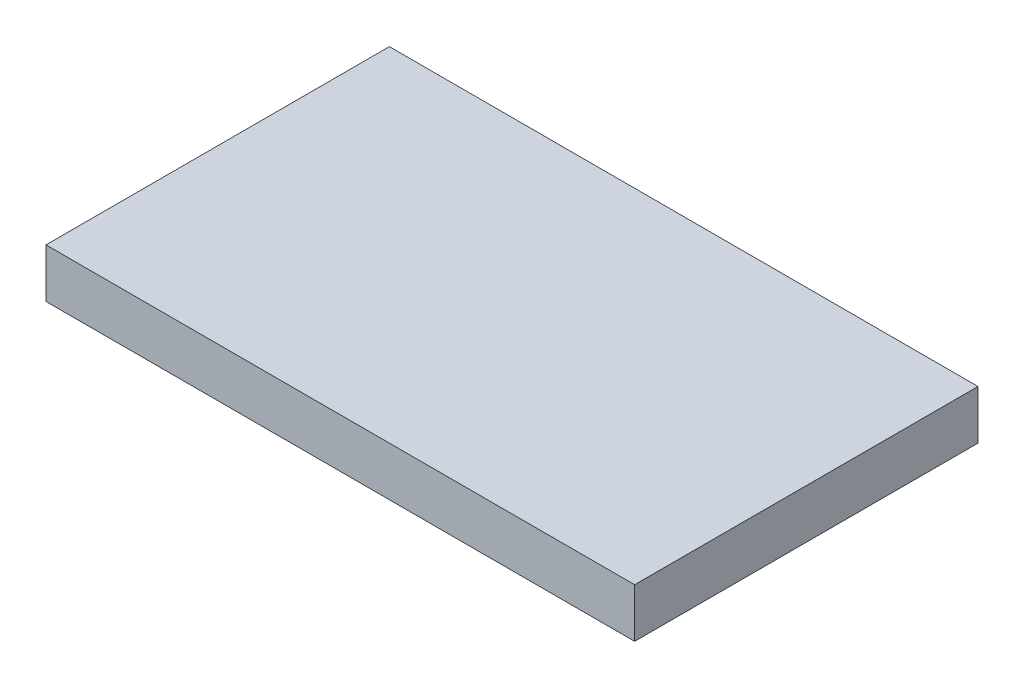
ISO-10303-21;
HEADER;
FILE_DESCRIPTION(('STEP AP214'),'2;1');
FILE_NAME('part.step','',(''),(''),'','','');
FILE_SCHEMA(('AUTOMOTIVE_DESIGN { 1 0 10303 214 1 1 1 1 }'));
ENDSEC;
DATA;
#1=APPLICATION_CONTEXT('core data for automotive mechanical design processes');
#2=APPLICATION_PROTOCOL_DEFINITION('international standard','automotive_design',2000,#1);
#3=PRODUCT_CONTEXT('',#1,'mechanical');
#4=PRODUCT('Part','Part','',(#3));
#5=PRODUCT_RELATED_PRODUCT_CATEGORY('part','',(#4));
#6=PRODUCT_DEFINITION_FORMATION('','',#4);
#7=PRODUCT_DEFINITION_CONTEXT('part definition',#1,'design');
#8=PRODUCT_DEFINITION('design','',#6,#7);
#9=PRODUCT_DEFINITION_SHAPE('','',#8);
#10=(LENGTH_UNIT() NAMED_UNIT(*) SI_UNIT(.MILLI.,.METRE.));
#11=(NAMED_UNIT(*) PLANE_ANGLE_UNIT() SI_UNIT($,.RADIAN.));
#12=(NAMED_UNIT(*) SI_UNIT($,.STERADIAN.) SOLID_ANGLE_UNIT());
#13=UNCERTAINTY_MEASURE_WITH_UNIT(LENGTH_MEASURE(1.E-05),#10,'distance_accuracy_value','');
#14=(GEOMETRIC_REPRESENTATION_CONTEXT(3) GLOBAL_UNCERTAINTY_ASSIGNED_CONTEXT((#13)) GLOBAL_UNIT_ASSIGNED_CONTEXT((#10,
#11,#12)) REPRESENTATION_CONTEXT('',''));
#15=CARTESIAN_POINT('',(0.,0.,0.));
#16=DIRECTION('',(0.,0.,1.));
#17=DIRECTION('',(1.,0.,0.));
#18=AXIS2_PLACEMENT_3D('',#15,#16,#17);
#19=CARTESIAN_POINT('',(0.,25.4,0.));
#20=DIRECTION('',(1.,0.,0.));
#21=DIRECTION('',(0.,0.,-1.));
#22=AXIS2_PLACEMENT_3D('',#19,#20,#21);
#23=PLANE('',#22);
#24=DIRECTION('',(0.,0.,1.));
#25=VECTOR('',#24,1.);
#26=CARTESIAN_POINT('',(0.,0.,0.));
#27=LINE('',#26,#25);
#28=CARTESIAN_POINT('',(0.,0.,-177.8));
#29=VERTEX_POINT('',#28);
#30=CARTESIAN_POINT('',(0.,0.,0.));
#31=VERTEX_POINT('',#30);
#32=EDGE_CURVE('E97',#29,#31,#27,.T.);
#33=ORIENTED_EDGE('',*,*,#32,.T.);
#34=DIRECTION('',(0.,-1.,0.));
#35=VECTOR('',#34,1.);
#36=CARTESIAN_POINT('',(0.,25.4,0.));
#37=LINE('',#36,#35);
#38=CARTESIAN_POINT('',(0.,25.4,0.));
#39=VERTEX_POINT('',#38);
#40=EDGE_CURVE('E11',#39,#31,#37,.T.);
#41=ORIENTED_EDGE('',*,*,#40,.F.);
#42=DIRECTION('',(0.,0.,1.));
#43=VECTOR('',#42,1.);
#44=CARTESIAN_POINT('',(0.,25.4,0.));
#45=LINE('',#44,#43);
#46=CARTESIAN_POINT('',(0.,25.4,-177.8));
#47=VERTEX_POINT('',#46);
#48=EDGE_CURVE('E85',#47,#39,#45,.T.);
#49=ORIENTED_EDGE('',*,*,#48,.F.);
#50=DIRECTION('',(0.,-1.,0.));
#51=VECTOR('',#50,1.);
#52=CARTESIAN_POINT('',(0.,25.4,-177.8));
#53=LINE('',#52,#51);
#54=EDGE_CURVE('E93',#47,#29,#53,.T.);
#55=ORIENTED_EDGE('',*,*,#54,.T.);
#56=EDGE_LOOP('',(#33,#41,#49,#55));
#57=FACE_BOUND('',#56,.T.);
#58=ADVANCED_FACE('F34',(#57),#23,.F.);
#59=CARTESIAN_POINT('',(0.,25.4,0.));
#60=DIRECTION('',(0.,0.,-1.));
#61=DIRECTION('',(-1.,0.,0.));
#62=AXIS2_PLACEMENT_3D('',#59,#60,#61);
#63=PLANE('',#62);
#64=DIRECTION('',(1.,0.,0.));
#65=VECTOR('',#64,1.);
#66=CARTESIAN_POINT('',(0.,0.,0.));
#67=LINE('',#66,#65);
#68=CARTESIAN_POINT('',(304.8,0.,0.));
#69=VERTEX_POINT('',#68);
#70=EDGE_CURVE('E89',#31,#69,#67,.T.);
#71=ORIENTED_EDGE('',*,*,#70,.T.);
#72=DIRECTION('',(0.,-1.,0.));
#73=VECTOR('',#72,1.);
#74=CARTESIAN_POINT('',(304.8,25.4,0.));
#75=LINE('',#74,#73);
#76=CARTESIAN_POINT('',(304.8,25.4,0.));
#77=VERTEX_POINT('',#76);
#78=EDGE_CURVE('E42',#77,#69,#75,.T.);
#79=ORIENTED_EDGE('',*,*,#78,.F.);
#80=DIRECTION('',(1.,0.,0.));
#81=VECTOR('',#80,1.);
#82=CARTESIAN_POINT('',(0.,25.4,0.));
#83=LINE('',#82,#81);
#84=EDGE_CURVE('E80',#39,#77,#83,.T.);
#85=ORIENTED_EDGE('',*,*,#84,.F.);
#86=ORIENTED_EDGE('',*,*,#40,.T.);
#87=EDGE_LOOP('',(#71,#79,#85,#86));
#88=FACE_BOUND('',#87,.T.);
#89=ADVANCED_FACE('F88',(#88),#63,.F.);
#90=CARTESIAN_POINT('',(304.8,25.4,0.));
#91=DIRECTION('',(-1.,0.,0.));
#92=DIRECTION('',(0.,0.,1.));
#93=AXIS2_PLACEMENT_3D('',#90,#91,#92);
#94=PLANE('',#93);
#95=DIRECTION('',(0.,0.,-1.));
#96=VECTOR('',#95,1.);
#97=CARTESIAN_POINT('',(304.8,0.,0.));
#98=LINE('',#97,#96);
#99=CARTESIAN_POINT('',(304.8,0.,-177.8));
#100=VERTEX_POINT('',#99);
#101=EDGE_CURVE('E67',#69,#100,#98,.T.);
#102=ORIENTED_EDGE('',*,*,#101,.T.);
#103=DIRECTION('',(0.,-1.,0.));
#104=VECTOR('',#103,1.);
#105=CARTESIAN_POINT('',(304.8,25.4,-177.8));
#106=LINE('',#105,#104);
#107=CARTESIAN_POINT('',(304.8,25.4,-177.8));
#108=VERTEX_POINT('',#107);
#109=EDGE_CURVE('E90',#108,#100,#106,.T.);
#110=ORIENTED_EDGE('',*,*,#109,.F.);
#111=DIRECTION('',(0.,0.,-1.));
#112=VECTOR('',#111,1.);
#113=CARTESIAN_POINT('',(304.8,25.4,0.));
#114=LINE('',#113,#112);
#115=EDGE_CURVE('E83',#77,#108,#114,.T.);
#116=ORIENTED_EDGE('',*,*,#115,.F.);
#117=ORIENTED_EDGE('',*,*,#78,.T.);
#118=EDGE_LOOP('',(#102,#110,#116,#117));
#119=FACE_BOUND('',#118,.T.);
#120=ADVANCED_FACE('F91',(#119),#94,.F.);
#121=CARTESIAN_POINT('',(0.,25.4,-177.8));
#122=DIRECTION('',(0.,0.,1.));
#123=DIRECTION('',(1.,0.,0.));
#124=AXIS2_PLACEMENT_3D('',#121,#122,#123);
#125=PLANE('',#124);
#126=DIRECTION('',(-1.,0.,0.));
#127=VECTOR('',#126,1.);
#128=CARTESIAN_POINT('',(0.,0.,-177.8));
#129=LINE('',#128,#127);
#130=EDGE_CURVE('E73',#100,#29,#129,.T.);
#131=ORIENTED_EDGE('',*,*,#130,.T.);
#132=ORIENTED_EDGE('',*,*,#54,.F.);
#133=DIRECTION('',(-1.,0.,0.));
#134=VECTOR('',#133,1.);
#135=CARTESIAN_POINT('',(0.,25.4,-177.8));
#136=LINE('',#135,#134);
#137=EDGE_CURVE('E50',#108,#47,#136,.T.);
#138=ORIENTED_EDGE('',*,*,#137,.F.);
#139=ORIENTED_EDGE('',*,*,#109,.T.);
#140=EDGE_LOOP('',(#131,#132,#138,#139));
#141=FACE_BOUND('',#140,.T.);
#142=ADVANCED_FACE('F104',(#141),#125,.F.);
#143=CARTESIAN_POINT('',(0.,25.4,-177.8));
#144=DIRECTION('',(0.,-1.,0.));
#145=DIRECTION('',(0.,0.,-1.));
#146=AXIS2_PLACEMENT_3D('',#143,#144,#145);
#147=PLANE('',#146);
#148=ORIENTED_EDGE('',*,*,#48,.T.);
#149=ORIENTED_EDGE('',*,*,#84,.T.);
#150=ORIENTED_EDGE('',*,*,#115,.T.);
#151=ORIENTED_EDGE('',*,*,#137,.T.);
#152=EDGE_LOOP('',(#148,#149,#150,#151));
#153=FACE_BOUND('',#152,.T.);
#154=ADVANCED_FACE('F81',(#153),#147,.F.);
#155=CARTESIAN_POINT('',(0.,0.,-177.8));
#156=DIRECTION('',(0.,-1.,0.));
#157=DIRECTION('',(0.,0.,-1.));
#158=AXIS2_PLACEMENT_3D('',#155,#156,#157);
#159=PLANE('',#158);
#160=ORIENTED_EDGE('',*,*,#32,.F.);
#161=ORIENTED_EDGE('',*,*,#130,.F.);
#162=ORIENTED_EDGE('',*,*,#101,.F.);
#163=ORIENTED_EDGE('',*,*,#70,.F.);
#164=EDGE_LOOP('',(#160,#161,#162,#163));
#165=FACE_BOUND('',#164,.T.);
#166=ADVANCED_FACE('F107',(#165),#159,.T.);
#167=CLOSED_SHELL('',(#58,#89,#120,#142,#154,#166));
#168=MANIFOLD_SOLID_BREP('B2',#167);
#169=ADVANCED_BREP_SHAPE_REPRESENTATION('',(#18,#168),#14);
#170=SHAPE_DEFINITION_REPRESENTATION(#9,#169);
ENDSEC;
END-ISO-10303-21;
